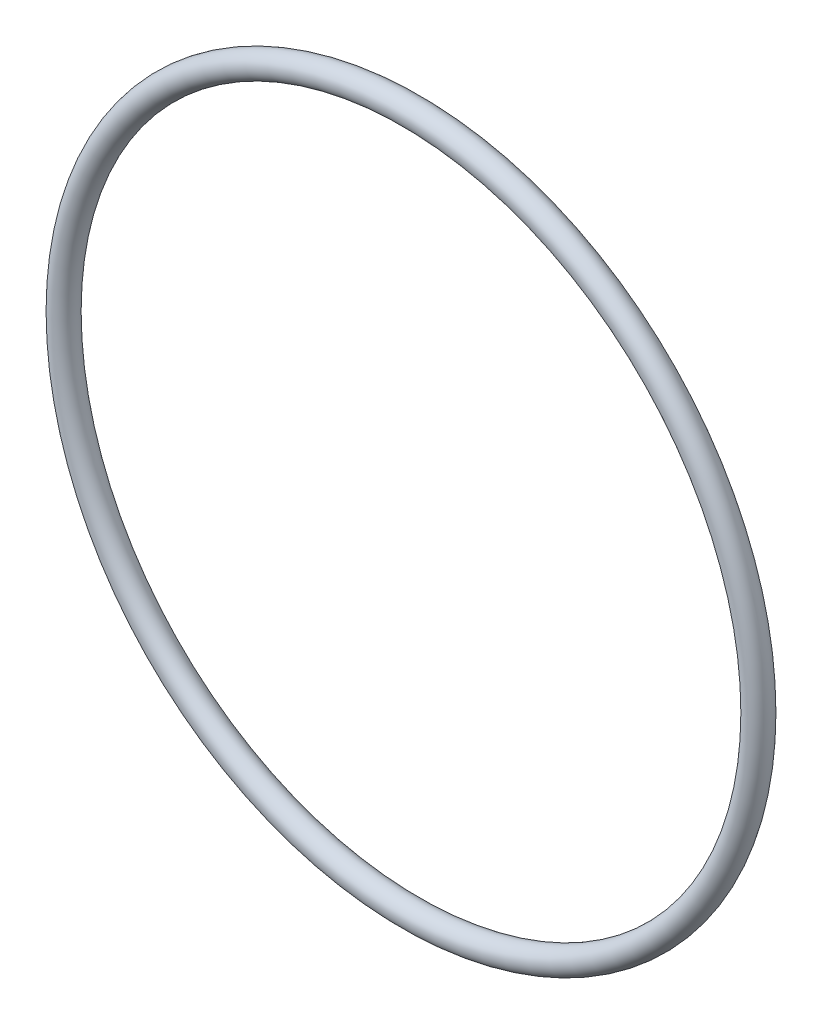
ISO-10303-21;
HEADER;
FILE_DESCRIPTION(('STEP AP214'),'2;1');
FILE_NAME('part.step','',(''),(''),'','','');
FILE_SCHEMA(('AUTOMOTIVE_DESIGN { 1 0 10303 214 1 1 1 1 }'));
ENDSEC;
DATA;
#1=APPLICATION_CONTEXT('core data for automotive mechanical design processes');
#2=APPLICATION_PROTOCOL_DEFINITION('international standard','automotive_design',2000,#1);
#3=PRODUCT_CONTEXT('',#1,'mechanical');
#4=PRODUCT('Part','Part','',(#3));
#5=PRODUCT_RELATED_PRODUCT_CATEGORY('part','',(#4));
#6=PRODUCT_DEFINITION_FORMATION('','',#4);
#7=PRODUCT_DEFINITION_CONTEXT('part definition',#1,'design');
#8=PRODUCT_DEFINITION('design','',#6,#7);
#9=PRODUCT_DEFINITION_SHAPE('','',#8);
#10=(LENGTH_UNIT() NAMED_UNIT(*) SI_UNIT(.MILLI.,.METRE.));
#11=(NAMED_UNIT(*) PLANE_ANGLE_UNIT() SI_UNIT($,.RADIAN.));
#12=(NAMED_UNIT(*) SI_UNIT($,.STERADIAN.) SOLID_ANGLE_UNIT());
#13=UNCERTAINTY_MEASURE_WITH_UNIT(LENGTH_MEASURE(1.E-05),#10,'distance_accuracy_value','');
#14=(GEOMETRIC_REPRESENTATION_CONTEXT(3) GLOBAL_UNCERTAINTY_ASSIGNED_CONTEXT((#13)) GLOBAL_UNIT_ASSIGNED_CONTEXT((#10,
#11,#12)) REPRESENTATION_CONTEXT('',''));
#15=CARTESIAN_POINT('',(0.,0.,0.));
#16=DIRECTION('',(0.,0.,1.));
#17=DIRECTION('',(1.,0.,0.));
#18=AXIS2_PLACEMENT_3D('',#15,#16,#17);
#19=CARTESIAN_POINT('',(0.,0.,1.2));
#20=DIRECTION('',(0.,0.,-1.));
#21=DIRECTION('',(-1.,0.,0.));
#22=AXIS2_PLACEMENT_3D('',#19,#20,#21);
#23=TOROIDAL_SURFACE('',#22,1.4,0.0499999999999999);
#24=CARTESIAN_POINT('',(-1.45,0.,1.2));
#25=VERTEX_POINT('',#24);
#26=VERTEX_LOOP('',#25);
#27=FACE_BOUND('',#26,.T.);
#28=ADVANCED_FACE('F13',(#27),#23,.T.);
#29=CLOSED_SHELL('',(#28));
#30=MANIFOLD_SOLID_BREP('B1',#29);
#31=ADVANCED_BREP_SHAPE_REPRESENTATION('',(#18,#30),#14);
#32=SHAPE_DEFINITION_REPRESENTATION(#9,#31);
ENDSEC;
END-ISO-10303-21;
